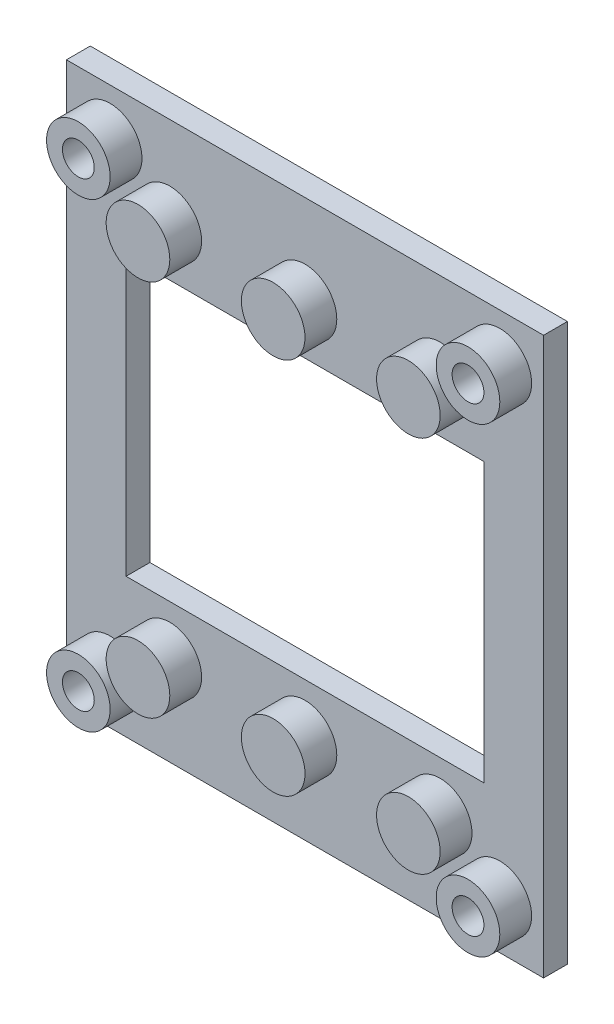
ISO-10303-21;
HEADER;
FILE_DESCRIPTION(('STEP AP214'),'2;1');
FILE_NAME('part.step','',(''),(''),'','','');
FILE_SCHEMA(('AUTOMOTIVE_DESIGN { 1 0 10303 214 1 1 1 1 }'));
ENDSEC;
DATA;
#1=APPLICATION_CONTEXT('core data for automotive mechanical design processes');
#2=APPLICATION_PROTOCOL_DEFINITION('international standard','automotive_design',2000,#1);
#3=PRODUCT_CONTEXT('',#1,'mechanical');
#4=PRODUCT('Part','Part','',(#3));
#5=PRODUCT_RELATED_PRODUCT_CATEGORY('part','',(#4));
#6=PRODUCT_DEFINITION_FORMATION('','',#4);
#7=PRODUCT_DEFINITION_CONTEXT('part definition',#1,'design');
#8=PRODUCT_DEFINITION('design','',#6,#7);
#9=PRODUCT_DEFINITION_SHAPE('','',#8);
#10=(LENGTH_UNIT() NAMED_UNIT(*) SI_UNIT(.MILLI.,.METRE.));
#11=(NAMED_UNIT(*) PLANE_ANGLE_UNIT() SI_UNIT($,.RADIAN.));
#12=(NAMED_UNIT(*) SI_UNIT($,.STERADIAN.) SOLID_ANGLE_UNIT());
#13=UNCERTAINTY_MEASURE_WITH_UNIT(LENGTH_MEASURE(1.E-05),#10,'distance_accuracy_value','');
#14=(GEOMETRIC_REPRESENTATION_CONTEXT(3) GLOBAL_UNCERTAINTY_ASSIGNED_CONTEXT((#13)) GLOBAL_UNIT_ASSIGNED_CONTEXT((#10,
#11,#12)) REPRESENTATION_CONTEXT('',''));
#15=CARTESIAN_POINT('',(0.,0.,0.));
#16=DIRECTION('',(0.,0.,1.));
#17=DIRECTION('',(1.,0.,0.));
#18=AXIS2_PLACEMENT_3D('',#15,#16,#17);
#19=CARTESIAN_POINT('',(0.,0.,0.));
#20=DIRECTION('',(0.,0.,1.));
#21=DIRECTION('',(1.,0.,0.));
#22=AXIS2_PLACEMENT_3D('',#19,#20,#21);
#23=PLANE('',#22);
#24=CARTESIAN_POINT('',(-1.67987721767761E-13,-23.75,0.));
#25=DIRECTION('',(0.,0.,1.));
#26=DIRECTION('',(1.,0.,0.));
#27=AXIS2_PLACEMENT_3D('',#24,#25,#26);
#28=CIRCLE('',#27,4.);
#29=CARTESIAN_POINT('',(3.99999999999983,-23.75,0.));
#30=VERTEX_POINT('',#29);
#31=EDGE_CURVE('E482',#30,#30,#28,.T.);
#32=ORIENTED_EDGE('',*,*,#31,.F.);
#33=EDGE_LOOP('',(#32));
#34=FACE_BOUND('',#33,.T.);
#35=CARTESIAN_POINT('',(16.9999999999998,23.75,0.));
#36=DIRECTION('',(0.,0.,1.));
#37=DIRECTION('',(1.,0.,0.));
#38=AXIS2_PLACEMENT_3D('',#35,#36,#37);
#39=CIRCLE('',#38,4.);
#40=CARTESIAN_POINT('',(20.9999999999998,23.75,0.));
#41=VERTEX_POINT('',#40);
#42=EDGE_CURVE('E492',#41,#41,#39,.T.);
#43=ORIENTED_EDGE('',*,*,#42,.F.);
#44=EDGE_LOOP('',(#43));
#45=FACE_BOUND('',#44,.T.);
#46=CARTESIAN_POINT('',(-17.0000000000002,23.75,0.));
#47=DIRECTION('',(0.,0.,1.));
#48=DIRECTION('',(1.,0.,0.));
#49=AXIS2_PLACEMENT_3D('',#46,#47,#48);
#50=CIRCLE('',#49,4.);
#51=CARTESIAN_POINT('',(-13.0000000000002,23.75,0.));
#52=VERTEX_POINT('',#51);
#53=EDGE_CURVE('E501',#52,#52,#50,.T.);
#54=ORIENTED_EDGE('',*,*,#53,.F.);
#55=EDGE_LOOP('',(#54));
#56=FACE_BOUND('',#55,.T.);
#57=DIRECTION('',(0.,1.,0.));
#58=VECTOR('',#57,1.);
#59=CARTESIAN_POINT('',(22.5,17.5,0.));
#60=LINE('',#59,#58);
#61=CARTESIAN_POINT('',(22.5,-17.5,0.));
#62=VERTEX_POINT('',#61);
#63=CARTESIAN_POINT('',(22.5,17.5,0.));
#64=VERTEX_POINT('',#63);
#65=EDGE_CURVE('E53',#62,#64,#60,.T.);
#66=ORIENTED_EDGE('',*,*,#65,.F.);
#67=DIRECTION('',(1.,0.,0.));
#68=VECTOR('',#67,1.);
#69=CARTESIAN_POINT('',(-22.5,-17.5,0.));
#70=LINE('',#69,#68);
#71=CARTESIAN_POINT('',(-22.5,-17.5,0.));
#72=VERTEX_POINT('',#71);
#73=EDGE_CURVE('E111',#72,#62,#70,.T.);
#74=ORIENTED_EDGE('',*,*,#73,.F.);
#75=DIRECTION('',(0.,-1.,0.));
#76=VECTOR('',#75,1.);
#77=CARTESIAN_POINT('',(-22.5,17.5,0.));
#78=LINE('',#77,#76);
#79=CARTESIAN_POINT('',(-22.5,17.5,0.));
#80=VERTEX_POINT('',#79);
#81=EDGE_CURVE('E131',#80,#72,#78,.T.);
#82=ORIENTED_EDGE('',*,*,#81,.F.);
#83=DIRECTION('',(-1.,0.,0.));
#84=VECTOR('',#83,1.);
#85=CARTESIAN_POINT('',(-22.5,17.5,0.));
#86=LINE('',#85,#84);
#87=EDGE_CURVE('E125',#64,#80,#86,.T.);
#88=ORIENTED_EDGE('',*,*,#87,.F.);
#89=EDGE_LOOP('',(#66,#74,#82,#88));
#90=FACE_BOUND('',#89,.T.);
#91=CARTESIAN_POINT('',(24.5,-29.,0.));
#92=DIRECTION('',(0.,0.,1.));
#93=DIRECTION('',(1.,0.,0.));
#94=AXIS2_PLACEMENT_3D('',#91,#92,#93);
#95=CIRCLE('',#94,4.);
#96=CARTESIAN_POINT('',(28.5,-29.,0.));
#97=VERTEX_POINT('',#96);
#98=EDGE_CURVE('E151',#97,#97,#95,.T.);
#99=ORIENTED_EDGE('',*,*,#98,.F.);
#100=EDGE_LOOP('',(#99));
#101=FACE_BOUND('',#100,.T.);
#102=CARTESIAN_POINT('',(-24.5,29.,0.));
#103=DIRECTION('',(0.,0.,1.));
#104=DIRECTION('',(1.,0.,0.));
#105=AXIS2_PLACEMENT_3D('',#102,#103,#104);
#106=CIRCLE('',#105,4.);
#107=CARTESIAN_POINT('',(-20.5,29.,0.));
#108=VERTEX_POINT('',#107);
#109=EDGE_CURVE('E169',#108,#108,#106,.T.);
#110=ORIENTED_EDGE('',*,*,#109,.F.);
#111=EDGE_LOOP('',(#110));
#112=FACE_BOUND('',#111,.T.);
#113=DIRECTION('',(0.,1.,0.));
#114=VECTOR('',#113,1.);
#115=CARTESIAN_POINT('',(30.,35.,0.));
#116=LINE('',#115,#114);
#117=CARTESIAN_POINT('',(30.,-35.,0.));
#118=VERTEX_POINT('',#117);
#119=CARTESIAN_POINT('',(30.,35.,0.));
#120=VERTEX_POINT('',#119);
#121=EDGE_CURVE('E193',#118,#120,#116,.T.);
#122=ORIENTED_EDGE('',*,*,#121,.T.);
#123=DIRECTION('',(-1.,0.,0.));
#124=VECTOR('',#123,1.);
#125=CARTESIAN_POINT('',(-30.,35.,0.));
#126=LINE('',#125,#124);
#127=CARTESIAN_POINT('',(-30.,35.,0.));
#128=VERTEX_POINT('',#127);
#129=EDGE_CURVE('E210',#120,#128,#126,.T.);
#130=ORIENTED_EDGE('',*,*,#129,.T.);
#131=DIRECTION('',(0.,-1.,0.));
#132=VECTOR('',#131,1.);
#133=CARTESIAN_POINT('',(-30.,35.,0.));
#134=LINE('',#133,#132);
#135=CARTESIAN_POINT('',(-30.,-35.,0.));
#136=VERTEX_POINT('',#135);
#137=EDGE_CURVE('E213',#128,#136,#134,.T.);
#138=ORIENTED_EDGE('',*,*,#137,.T.);
#139=DIRECTION('',(1.,0.,0.));
#140=VECTOR('',#139,1.);
#141=CARTESIAN_POINT('',(-30.,-35.,0.));
#142=LINE('',#141,#140);
#143=EDGE_CURVE('E198',#136,#118,#142,.T.);
#144=ORIENTED_EDGE('',*,*,#143,.T.);
#145=EDGE_LOOP('',(#122,#130,#138,#144));
#146=FACE_BOUND('',#145,.T.);
#147=CARTESIAN_POINT('',(24.4999999999998,29.,0.));
#148=DIRECTION('',(0.,0.,1.));
#149=DIRECTION('',(1.,0.,0.));
#150=AXIS2_PLACEMENT_3D('',#147,#148,#149);
#151=CIRCLE('',#150,4.);
#152=CARTESIAN_POINT('',(28.4999999999998,29.,0.));
#153=VERTEX_POINT('',#152);
#154=EDGE_CURVE('E160',#153,#153,#151,.T.);
#155=ORIENTED_EDGE('',*,*,#154,.F.);
#156=EDGE_LOOP('',(#155));
#157=FACE_BOUND('',#156,.T.);
#158=CARTESIAN_POINT('',(-24.5,-29.,0.));
#159=DIRECTION('',(0.,0.,1.));
#160=DIRECTION('',(1.,0.,0.));
#161=AXIS2_PLACEMENT_3D('',#158,#159,#160);
#162=CIRCLE('',#161,4.);
#163=CARTESIAN_POINT('',(-20.5,-29.,0.));
#164=VERTEX_POINT('',#163);
#165=EDGE_CURVE('E142',#164,#164,#162,.T.);
#166=ORIENTED_EDGE('',*,*,#165,.F.);
#167=EDGE_LOOP('',(#166));
#168=FACE_BOUND('',#167,.T.);
#169=CARTESIAN_POINT('',(-1.65079185619786E-13,23.75,0.));
#170=DIRECTION('',(0.,0.,1.));
#171=DIRECTION('',(1.,0.,0.));
#172=AXIS2_PLACEMENT_3D('',#169,#170,#171);
#173=CIRCLE('',#172,4.);
#174=CARTESIAN_POINT('',(3.99999999999984,23.75,0.));
#175=VERTEX_POINT('',#174);
#176=EDGE_CURVE('E497',#175,#175,#173,.T.);
#177=ORIENTED_EDGE('',*,*,#176,.F.);
#178=EDGE_LOOP('',(#177));
#179=FACE_BOUND('',#178,.T.);
#180=CARTESIAN_POINT('',(16.9999999999998,-23.75,0.));
#181=DIRECTION('',(0.,0.,1.));
#182=DIRECTION('',(1.,0.,0.));
#183=AXIS2_PLACEMENT_3D('',#180,#181,#182);
#184=CIRCLE('',#183,4.);
#185=CARTESIAN_POINT('',(20.9999999999998,-23.75,0.));
#186=VERTEX_POINT('',#185);
#187=EDGE_CURVE('E487',#186,#186,#184,.T.);
#188=ORIENTED_EDGE('',*,*,#187,.F.);
#189=EDGE_LOOP('',(#188));
#190=FACE_BOUND('',#189,.T.);
#191=CARTESIAN_POINT('',(-17.0000000000002,-23.75,0.));
#192=DIRECTION('',(0.,0.,1.));
#193=DIRECTION('',(1.,0.,0.));
#194=AXIS2_PLACEMENT_3D('',#191,#192,#193);
#195=CIRCLE('',#194,4.);
#196=CARTESIAN_POINT('',(-13.0000000000002,-23.75,0.));
#197=VERTEX_POINT('',#196);
#198=EDGE_CURVE('E479',#197,#197,#195,.T.);
#199=ORIENTED_EDGE('',*,*,#198,.F.);
#200=EDGE_LOOP('',(#199));
#201=FACE_BOUND('',#200,.T.);
#202=ADVANCED_FACE('F38',(#34,#45,#56,#90,#101,#112,#146,#157,#168,#179,#190,#201),#23,.T.);
#203=CARTESIAN_POINT('',(24.4999999999998,29.,-3.001));
#204=DIRECTION('',(0.,0.,1.));
#205=DIRECTION('',(1.,0.,0.));
#206=AXIS2_PLACEMENT_3D('',#203,#204,#205);
#207=CYLINDRICAL_SURFACE('',#206,2.);
#208=CARTESIAN_POINT('',(24.4999999999998,29.,4.));
#209=DIRECTION('',(0.,0.,1.));
#210=DIRECTION('',(1.,0.,0.));
#211=AXIS2_PLACEMENT_3D('',#208,#209,#210);
#212=CIRCLE('',#211,2.);
#213=CARTESIAN_POINT('',(26.4999999999998,29.,4.));
#214=VERTEX_POINT('',#213);
#215=EDGE_CURVE('E155',#214,#214,#212,.T.);
#216=ORIENTED_EDGE('',*,*,#215,.T.);
#217=EDGE_LOOP('',(#216));
#218=FACE_BOUND('',#217,.T.);
#219=CARTESIAN_POINT('',(24.4999999999998,29.,-2.));
#220=DIRECTION('',(0.,0.,-1.));
#221=DIRECTION('',(-1.,0.,0.));
#222=AXIS2_PLACEMENT_3D('',#219,#220,#221);
#223=CIRCLE('',#222,2.);
#224=CARTESIAN_POINT('',(22.4999999999998,29.,-2.));
#225=VERTEX_POINT('',#224);
#226=EDGE_CURVE('E11',#225,#225,#223,.F.);
#227=ORIENTED_EDGE('',*,*,#226,.F.);
#228=EDGE_LOOP('',(#227));
#229=FACE_BOUND('',#228,.T.);
#230=ADVANCED_FACE('F238',(#218,#229),#207,.F.);
#231=CARTESIAN_POINT('',(-24.5,29.,-3.001));
#232=DIRECTION('',(0.,0.,1.));
#233=DIRECTION('',(1.,0.,0.));
#234=AXIS2_PLACEMENT_3D('',#231,#232,#233);
#235=CYLINDRICAL_SURFACE('',#234,2.);
#236=CARTESIAN_POINT('',(-24.5,29.,4.));
#237=DIRECTION('',(0.,0.,1.));
#238=DIRECTION('',(1.,0.,0.));
#239=AXIS2_PLACEMENT_3D('',#236,#237,#238);
#240=CIRCLE('',#239,2.);
#241=CARTESIAN_POINT('',(-22.5,29.,4.));
#242=VERTEX_POINT('',#241);
#243=EDGE_CURVE('E164',#242,#242,#240,.T.);
#244=ORIENTED_EDGE('',*,*,#243,.T.);
#245=EDGE_LOOP('',(#244));
#246=FACE_BOUND('',#245,.T.);
#247=CARTESIAN_POINT('',(-24.5,29.,-2.));
#248=DIRECTION('',(0.,0.,-1.));
#249=DIRECTION('',(-1.,0.,0.));
#250=AXIS2_PLACEMENT_3D('',#247,#248,#249);
#251=CIRCLE('',#250,2.);
#252=CARTESIAN_POINT('',(-26.5,29.,-2.));
#253=VERTEX_POINT('',#252);
#254=EDGE_CURVE('E46',#253,#253,#251,.F.);
#255=ORIENTED_EDGE('',*,*,#254,.F.);
#256=EDGE_LOOP('',(#255));
#257=FACE_BOUND('',#256,.T.);
#258=ADVANCED_FACE('F235',(#246,#257),#235,.F.);
#259=CARTESIAN_POINT('',(-24.5,-29.,-3.001));
#260=DIRECTION('',(0.,0.,1.));
#261=DIRECTION('',(1.,0.,0.));
#262=AXIS2_PLACEMENT_3D('',#259,#260,#261);
#263=CYLINDRICAL_SURFACE('',#262,2.);
#264=CARTESIAN_POINT('',(-24.5,-29.,4.));
#265=DIRECTION('',(0.,0.,1.));
#266=DIRECTION('',(1.,0.,0.));
#267=AXIS2_PLACEMENT_3D('',#264,#265,#266);
#268=CIRCLE('',#267,2.);
#269=CARTESIAN_POINT('',(-22.5,-29.,4.));
#270=VERTEX_POINT('',#269);
#271=EDGE_CURVE('E117',#270,#270,#268,.T.);
#272=ORIENTED_EDGE('',*,*,#271,.T.);
#273=EDGE_LOOP('',(#272));
#274=FACE_BOUND('',#273,.T.);
#275=CARTESIAN_POINT('',(-24.5,-29.,-2.));
#276=DIRECTION('',(0.,0.,-1.));
#277=DIRECTION('',(-1.,0.,0.));
#278=AXIS2_PLACEMENT_3D('',#275,#276,#277);
#279=CIRCLE('',#278,2.);
#280=CARTESIAN_POINT('',(-26.5,-29.,-2.));
#281=VERTEX_POINT('',#280);
#282=EDGE_CURVE('E228',#281,#281,#279,.F.);
#283=ORIENTED_EDGE('',*,*,#282,.F.);
#284=EDGE_LOOP('',(#283));
#285=FACE_BOUND('',#284,.T.);
#286=ADVANCED_FACE('F237',(#274,#285),#263,.F.);
#287=CARTESIAN_POINT('',(24.5,-29.,-3.001));
#288=DIRECTION('',(0.,0.,1.));
#289=DIRECTION('',(1.,0.,0.));
#290=AXIS2_PLACEMENT_3D('',#287,#288,#289);
#291=CYLINDRICAL_SURFACE('',#290,2.);
#292=CARTESIAN_POINT('',(24.5,-29.,4.));
#293=DIRECTION('',(0.,0.,1.));
#294=DIRECTION('',(1.,0.,0.));
#295=AXIS2_PLACEMENT_3D('',#292,#293,#294);
#296=CIRCLE('',#295,2.);
#297=CARTESIAN_POINT('',(26.5,-29.,4.));
#298=VERTEX_POINT('',#297);
#299=EDGE_CURVE('E146',#298,#298,#296,.T.);
#300=ORIENTED_EDGE('',*,*,#299,.T.);
#301=EDGE_LOOP('',(#300));
#302=FACE_BOUND('',#301,.T.);
#303=CARTESIAN_POINT('',(24.5,-29.,-2.));
#304=DIRECTION('',(0.,0.,-1.));
#305=DIRECTION('',(-1.,0.,0.));
#306=AXIS2_PLACEMENT_3D('',#303,#304,#305);
#307=CIRCLE('',#306,2.);
#308=CARTESIAN_POINT('',(22.5,-29.,-2.));
#309=VERTEX_POINT('',#308);
#310=EDGE_CURVE('E220',#309,#309,#307,.F.);
#311=ORIENTED_EDGE('',*,*,#310,.F.);
#312=EDGE_LOOP('',(#311));
#313=FACE_BOUND('',#312,.T.);
#314=ADVANCED_FACE('F245',(#302,#313),#291,.F.);
#315=CARTESIAN_POINT('',(30.,35.,-3.));
#316=DIRECTION('',(1.,0.,0.));
#317=DIRECTION('',(0.,1.,0.));
#318=AXIS2_PLACEMENT_3D('',#315,#316,#317);
#319=PLANE('',#318);
#320=ORIENTED_EDGE('',*,*,#121,.F.);
#321=DIRECTION('',(0.,0.,1.));
#322=VECTOR('',#321,1.);
#323=CARTESIAN_POINT('',(30.,-35.,-3.));
#324=LINE('',#323,#322);
#325=CARTESIAN_POINT('',(30.,-35.,-3.));
#326=VERTEX_POINT('',#325);
#327=EDGE_CURVE('E218',#326,#118,#324,.T.);
#328=ORIENTED_EDGE('',*,*,#327,.F.);
#329=DIRECTION('',(0.,1.,0.));
#330=VECTOR('',#329,1.);
#331=CARTESIAN_POINT('',(30.,35.,-3.));
#332=LINE('',#331,#330);
#333=CARTESIAN_POINT('',(30.,35.,-3.));
#334=VERTEX_POINT('',#333);
#335=EDGE_CURVE('E194',#326,#334,#332,.T.);
#336=ORIENTED_EDGE('',*,*,#335,.T.);
#337=DIRECTION('',(0.,0.,1.));
#338=VECTOR('',#337,1.);
#339=CARTESIAN_POINT('',(30.,35.,-3.));
#340=LINE('',#339,#338);
#341=EDGE_CURVE('E207',#334,#120,#340,.T.);
#342=ORIENTED_EDGE('',*,*,#341,.T.);
#343=EDGE_LOOP('',(#320,#328,#336,#342));
#344=FACE_BOUND('',#343,.T.);
#345=ADVANCED_FACE('F40',(#344),#319,.T.);
#346=CARTESIAN_POINT('',(-30.,-35.,-3.));
#347=DIRECTION('',(0.,-1.,0.));
#348=DIRECTION('',(0.,0.,-1.));
#349=AXIS2_PLACEMENT_3D('',#346,#347,#348);
#350=PLANE('',#349);
#351=ORIENTED_EDGE('',*,*,#143,.F.);
#352=DIRECTION('',(0.,0.,1.));
#353=VECTOR('',#352,1.);
#354=CARTESIAN_POINT('',(-30.,-35.,-3.));
#355=LINE('',#354,#353);
#356=CARTESIAN_POINT('',(-30.,-35.,-3.));
#357=VERTEX_POINT('',#356);
#358=EDGE_CURVE('E221',#357,#136,#355,.T.);
#359=ORIENTED_EDGE('',*,*,#358,.F.);
#360=DIRECTION('',(1.,0.,0.));
#361=VECTOR('',#360,1.);
#362=CARTESIAN_POINT('',(-30.,-35.,-3.));
#363=LINE('',#362,#361);
#364=EDGE_CURVE('E204',#357,#326,#363,.T.);
#365=ORIENTED_EDGE('',*,*,#364,.T.);
#366=ORIENTED_EDGE('',*,*,#327,.T.);
#367=EDGE_LOOP('',(#351,#359,#365,#366));
#368=FACE_BOUND('',#367,.T.);
#369=ADVANCED_FACE('F259',(#368),#350,.T.);
#370=CARTESIAN_POINT('',(-30.,35.,-3.));
#371=DIRECTION('',(-1.,0.,0.));
#372=DIRECTION('',(0.,-1.,0.));
#373=AXIS2_PLACEMENT_3D('',#370,#371,#372);
#374=PLANE('',#373);
#375=ORIENTED_EDGE('',*,*,#137,.F.);
#376=DIRECTION('',(0.,0.,1.));
#377=VECTOR('',#376,1.);
#378=CARTESIAN_POINT('',(-30.,35.,-3.));
#379=LINE('',#378,#377);
#380=CARTESIAN_POINT('',(-30.,35.,-3.));
#381=VERTEX_POINT('',#380);
#382=EDGE_CURVE('E223',#381,#128,#379,.T.);
#383=ORIENTED_EDGE('',*,*,#382,.F.);
#384=DIRECTION('',(0.,-1.,0.));
#385=VECTOR('',#384,1.);
#386=CARTESIAN_POINT('',(-30.,35.,-3.));
#387=LINE('',#386,#385);
#388=EDGE_CURVE('E201',#381,#357,#387,.T.);
#389=ORIENTED_EDGE('',*,*,#388,.T.);
#390=ORIENTED_EDGE('',*,*,#358,.T.);
#391=EDGE_LOOP('',(#375,#383,#389,#390));
#392=FACE_BOUND('',#391,.T.);
#393=ADVANCED_FACE('F262',(#392),#374,.T.);
#394=CARTESIAN_POINT('',(-30.,35.,-3.));
#395=DIRECTION('',(0.,1.,0.));
#396=DIRECTION('',(0.,0.,1.));
#397=AXIS2_PLACEMENT_3D('',#394,#395,#396);
#398=PLANE('',#397);
#399=ORIENTED_EDGE('',*,*,#129,.F.);
#400=ORIENTED_EDGE('',*,*,#341,.F.);
#401=DIRECTION('',(-1.,0.,0.));
#402=VECTOR('',#401,1.);
#403=CARTESIAN_POINT('',(-30.,35.,-3.));
#404=LINE('',#403,#402);
#405=EDGE_CURVE('E197',#334,#381,#404,.T.);
#406=ORIENTED_EDGE('',*,*,#405,.T.);
#407=ORIENTED_EDGE('',*,*,#382,.T.);
#408=EDGE_LOOP('',(#399,#400,#406,#407));
#409=FACE_BOUND('',#408,.T.);
#410=ADVANCED_FACE('F265',(#409),#398,.T.);
#411=CARTESIAN_POINT('',(0.,0.,-3.));
#412=DIRECTION('',(0.,0.,1.));
#413=DIRECTION('',(1.,0.,0.));
#414=AXIS2_PLACEMENT_3D('',#411,#412,#413);
#415=PLANE('',#414);
#416=DIRECTION('',(-1.,0.,0.));
#417=VECTOR('',#416,1.);
#418=CARTESIAN_POINT('',(-22.5,-17.5,-3.));
#419=LINE('',#418,#417);
#420=CARTESIAN_POINT('',(22.5,-17.5,-3.));
#421=VERTEX_POINT('',#420);
#422=CARTESIAN_POINT('',(-22.5,-17.5,-3.));
#423=VERTEX_POINT('',#422);
#424=EDGE_CURVE('E123',#421,#423,#419,.T.);
#425=ORIENTED_EDGE('',*,*,#424,.F.);
#426=DIRECTION('',(0.,-1.,0.));
#427=VECTOR('',#426,1.);
#428=CARTESIAN_POINT('',(22.5,17.5,-3.));
#429=LINE('',#428,#427);
#430=CARTESIAN_POINT('',(22.5,17.5,-3.));
#431=VERTEX_POINT('',#430);
#432=EDGE_CURVE('E105',#431,#421,#429,.T.);
#433=ORIENTED_EDGE('',*,*,#432,.F.);
#434=DIRECTION('',(1.,0.,0.));
#435=VECTOR('',#434,1.);
#436=CARTESIAN_POINT('',(-22.5,17.5,-3.));
#437=LINE('',#436,#435);
#438=CARTESIAN_POINT('',(-22.5,17.5,-3.));
#439=VERTEX_POINT('',#438);
#440=EDGE_CURVE('E114',#439,#431,#437,.T.);
#441=ORIENTED_EDGE('',*,*,#440,.F.);
#442=DIRECTION('',(0.,1.,0.));
#443=VECTOR('',#442,1.);
#444=CARTESIAN_POINT('',(-22.5,17.5,-3.));
#445=LINE('',#444,#443);
#446=EDGE_CURVE('E61',#423,#439,#445,.T.);
#447=ORIENTED_EDGE('',*,*,#446,.F.);
#448=EDGE_LOOP('',(#425,#433,#441,#447));
#449=FACE_BOUND('',#448,.T.);
#450=CARTESIAN_POINT('',(-17.0000000000002,23.75,-3.));
#451=DIRECTION('',(0.,0.,1.));
#452=DIRECTION('',(1.,0.,0.));
#453=AXIS2_PLACEMENT_3D('',#450,#451,#452);
#454=CIRCLE('',#453,2.);
#455=CARTESIAN_POINT('',(-15.0000000000002,23.75,-3.));
#456=VERTEX_POINT('',#455);
#457=EDGE_CURVE('E173',#456,#456,#454,.F.);
#458=ORIENTED_EDGE('',*,*,#457,.F.);
#459=EDGE_LOOP('',(#458));
#460=FACE_BOUND('',#459,.T.);
#461=CARTESIAN_POINT('',(16.9999999999998,23.75,-3.));
#462=DIRECTION('',(0.,0.,1.));
#463=DIRECTION('',(1.,0.,0.));
#464=AXIS2_PLACEMENT_3D('',#461,#462,#463);
#465=CIRCLE('',#464,2.);
#466=CARTESIAN_POINT('',(18.9999999999998,23.75,-3.));
#467=VERTEX_POINT('',#466);
#468=EDGE_CURVE('E186',#467,#467,#465,.F.);
#469=ORIENTED_EDGE('',*,*,#468,.F.);
#470=EDGE_LOOP('',(#469));
#471=FACE_BOUND('',#470,.T.);
#472=CARTESIAN_POINT('',(-1.65079185619786E-13,23.75,-3.));
#473=DIRECTION('',(0.,0.,1.));
#474=DIRECTION('',(1.,0.,0.));
#475=AXIS2_PLACEMENT_3D('',#472,#473,#474);
#476=CIRCLE('',#475,2.);
#477=CARTESIAN_POINT('',(1.99999999999984,23.75,-3.));
#478=VERTEX_POINT('',#477);
#479=EDGE_CURVE('E183',#478,#478,#476,.F.);
#480=ORIENTED_EDGE('',*,*,#479,.F.);
#481=EDGE_LOOP('',(#480));
#482=FACE_BOUND('',#481,.T.);
#483=CARTESIAN_POINT('',(16.9999999999998,-23.75,-3.));
#484=DIRECTION('',(0.,0.,1.));
#485=DIRECTION('',(1.,0.,0.));
#486=AXIS2_PLACEMENT_3D('',#483,#484,#485);
#487=CIRCLE('',#486,2.);
#488=CARTESIAN_POINT('',(18.9999999999998,-23.75,-3.));
#489=VERTEX_POINT('',#488);
#490=EDGE_CURVE('E180',#489,#489,#487,.F.);
#491=ORIENTED_EDGE('',*,*,#490,.F.);
#492=EDGE_LOOP('',(#491));
#493=FACE_BOUND('',#492,.T.);
#494=CARTESIAN_POINT('',(-1.67987721767761E-13,-23.75,-3.));
#495=DIRECTION('',(0.,0.,1.));
#496=DIRECTION('',(1.,0.,0.));
#497=AXIS2_PLACEMENT_3D('',#494,#495,#496);
#498=CIRCLE('',#497,2.);
#499=CARTESIAN_POINT('',(1.99999999999983,-23.75,-3.));
#500=VERTEX_POINT('',#499);
#501=EDGE_CURVE('E176',#500,#500,#498,.F.);
#502=ORIENTED_EDGE('',*,*,#501,.F.);
#503=EDGE_LOOP('',(#502));
#504=FACE_BOUND('',#503,.T.);
#505=CARTESIAN_POINT('',(-17.0000000000002,-23.75,-3.));
#506=DIRECTION('',(0.,0.,1.));
#507=DIRECTION('',(1.,0.,0.));
#508=AXIS2_PLACEMENT_3D('',#505,#506,#507);
#509=CIRCLE('',#508,2.);
#510=CARTESIAN_POINT('',(-15.0000000000002,-23.75,-3.));
#511=VERTEX_POINT('',#510);
#512=EDGE_CURVE('E179',#511,#511,#509,.F.);
#513=ORIENTED_EDGE('',*,*,#512,.F.);
#514=EDGE_LOOP('',(#513));
#515=FACE_BOUND('',#514,.T.);
#516=ORIENTED_EDGE('',*,*,#335,.F.);
#517=ORIENTED_EDGE('',*,*,#364,.F.);
#518=ORIENTED_EDGE('',*,*,#388,.F.);
#519=ORIENTED_EDGE('',*,*,#405,.F.);
#520=EDGE_LOOP('',(#516,#517,#518,#519));
#521=FACE_BOUND('',#520,.T.);
#522=ADVANCED_FACE('F120',(#449,#460,#471,#482,#493,#504,#515,#521),#415,.F.);
#523=CARTESIAN_POINT('',(-17.0000000000002,-23.75,-3.001));
#524=DIRECTION('',(0.,0.,1.));
#525=DIRECTION('',(1.,0.,0.));
#526=AXIS2_PLACEMENT_3D('',#523,#524,#525);
#527=CYLINDRICAL_SURFACE('',#526,2.);
#528=ORIENTED_EDGE('',*,*,#512,.T.);
#529=EDGE_LOOP('',(#528));
#530=FACE_BOUND('',#529,.T.);
#531=CARTESIAN_POINT('',(-17.0000000000002,-23.75,3.));
#532=DIRECTION('',(0.,0.,1.));
#533=DIRECTION('',(1.,0.,0.));
#534=AXIS2_PLACEMENT_3D('',#531,#532,#533);
#535=CIRCLE('',#534,2.);
#536=CARTESIAN_POINT('',(-15.0000000000002,-23.75,3.));
#537=VERTEX_POINT('',#536);
#538=EDGE_CURVE('E476',#537,#537,#535,.T.);
#539=ORIENTED_EDGE('',*,*,#538,.T.);
#540=EDGE_LOOP('',(#539));
#541=FACE_BOUND('',#540,.T.);
#542=ADVANCED_FACE('F272',(#530,#541),#527,.F.);
#543=CARTESIAN_POINT('',(-1.67987721767761E-13,-23.75,-3.001));
#544=DIRECTION('',(0.,0.,1.));
#545=DIRECTION('',(1.,0.,0.));
#546=AXIS2_PLACEMENT_3D('',#543,#544,#545);
#547=CYLINDRICAL_SURFACE('',#546,2.);
#548=ORIENTED_EDGE('',*,*,#501,.T.);
#549=EDGE_LOOP('',(#548));
#550=FACE_BOUND('',#549,.T.);
#551=CARTESIAN_POINT('',(-1.67987721767761E-13,-23.75,3.));
#552=DIRECTION('',(0.,0.,1.));
#553=DIRECTION('',(1.,0.,0.));
#554=AXIS2_PLACEMENT_3D('',#551,#552,#553);
#555=CIRCLE('',#554,2.);
#556=CARTESIAN_POINT('',(1.99999999999983,-23.75,3.));
#557=VERTEX_POINT('',#556);
#558=EDGE_CURVE('E472',#557,#557,#555,.T.);
#559=ORIENTED_EDGE('',*,*,#558,.T.);
#560=EDGE_LOOP('',(#559));
#561=FACE_BOUND('',#560,.T.);
#562=ADVANCED_FACE('F297',(#550,#561),#547,.F.);
#563=CARTESIAN_POINT('',(16.9999999999998,-23.75,-3.001));
#564=DIRECTION('',(0.,0.,1.));
#565=DIRECTION('',(1.,0.,0.));
#566=AXIS2_PLACEMENT_3D('',#563,#564,#565);
#567=CYLINDRICAL_SURFACE('',#566,2.);
#568=ORIENTED_EDGE('',*,*,#490,.T.);
#569=EDGE_LOOP('',(#568));
#570=FACE_BOUND('',#569,.T.);
#571=CARTESIAN_POINT('',(16.9999999999998,-23.75,3.));
#572=DIRECTION('',(0.,0.,1.));
#573=DIRECTION('',(1.,0.,0.));
#574=AXIS2_PLACEMENT_3D('',#571,#572,#573);
#575=CIRCLE('',#574,2.);
#576=CARTESIAN_POINT('',(18.9999999999998,-23.75,3.));
#577=VERTEX_POINT('',#576);
#578=EDGE_CURVE('E468',#577,#577,#575,.T.);
#579=ORIENTED_EDGE('',*,*,#578,.T.);
#580=EDGE_LOOP('',(#579));
#581=FACE_BOUND('',#580,.T.);
#582=ADVANCED_FACE('F311',(#570,#581),#567,.F.);
#583=CARTESIAN_POINT('',(-1.65079185619786E-13,23.75,-3.001));
#584=DIRECTION('',(0.,0.,1.));
#585=DIRECTION('',(1.,0.,0.));
#586=AXIS2_PLACEMENT_3D('',#583,#584,#585);
#587=CYLINDRICAL_SURFACE('',#586,2.);
#588=ORIENTED_EDGE('',*,*,#479,.T.);
#589=EDGE_LOOP('',(#588));
#590=FACE_BOUND('',#589,.T.);
#591=CARTESIAN_POINT('',(-1.65079185619786E-13,23.75,3.));
#592=DIRECTION('',(0.,0.,1.));
#593=DIRECTION('',(1.,0.,0.));
#594=AXIS2_PLACEMENT_3D('',#591,#592,#593);
#595=CIRCLE('',#594,2.);
#596=CARTESIAN_POINT('',(1.99999999999984,23.75,3.));
#597=VERTEX_POINT('',#596);
#598=EDGE_CURVE('E460',#597,#597,#595,.T.);
#599=ORIENTED_EDGE('',*,*,#598,.T.);
#600=EDGE_LOOP('',(#599));
#601=FACE_BOUND('',#600,.T.);
#602=ADVANCED_FACE('F307',(#590,#601),#587,.F.);
#603=CARTESIAN_POINT('',(16.9999999999998,23.75,-3.001));
#604=DIRECTION('',(0.,0.,1.));
#605=DIRECTION('',(1.,0.,0.));
#606=AXIS2_PLACEMENT_3D('',#603,#604,#605);
#607=CYLINDRICAL_SURFACE('',#606,2.);
#608=ORIENTED_EDGE('',*,*,#468,.T.);
#609=EDGE_LOOP('',(#608));
#610=FACE_BOUND('',#609,.T.);
#611=CARTESIAN_POINT('',(16.9999999999998,23.75,3.));
#612=DIRECTION('',(0.,0.,1.));
#613=DIRECTION('',(1.,0.,0.));
#614=AXIS2_PLACEMENT_3D('',#611,#612,#613);
#615=CIRCLE('',#614,2.);
#616=CARTESIAN_POINT('',(18.9999999999998,23.75,3.));
#617=VERTEX_POINT('',#616);
#618=EDGE_CURVE('E464',#617,#617,#615,.T.);
#619=ORIENTED_EDGE('',*,*,#618,.T.);
#620=EDGE_LOOP('',(#619));
#621=FACE_BOUND('',#620,.T.);
#622=ADVANCED_FACE('F303',(#610,#621),#607,.F.);
#623=CARTESIAN_POINT('',(-17.0000000000002,23.75,-3.001));
#624=DIRECTION('',(0.,0.,1.));
#625=DIRECTION('',(1.,0.,0.));
#626=AXIS2_PLACEMENT_3D('',#623,#624,#625);
#627=CYLINDRICAL_SURFACE('',#626,2.);
#628=ORIENTED_EDGE('',*,*,#457,.T.);
#629=EDGE_LOOP('',(#628));
#630=FACE_BOUND('',#629,.T.);
#631=CARTESIAN_POINT('',(-17.0000000000002,23.75,3.));
#632=DIRECTION('',(0.,0.,1.));
#633=DIRECTION('',(1.,0.,0.));
#634=AXIS2_PLACEMENT_3D('',#631,#632,#633);
#635=CIRCLE('',#634,2.);
#636=CARTESIAN_POINT('',(-15.0000000000002,23.75,3.));
#637=VERTEX_POINT('',#636);
#638=EDGE_CURVE('E452',#637,#637,#635,.T.);
#639=ORIENTED_EDGE('',*,*,#638,.T.);
#640=EDGE_LOOP('',(#639));
#641=FACE_BOUND('',#640,.T.);
#642=ADVANCED_FACE('F299',(#630,#641),#627,.F.);
#643=CARTESIAN_POINT('',(-24.5,29.,4.));
#644=DIRECTION('',(0.,0.,1.));
#645=DIRECTION('',(1.,0.,0.));
#646=AXIS2_PLACEMENT_3D('',#643,#644,#645);
#647=PLANE('',#646);
#648=CARTESIAN_POINT('',(-24.5,29.,4.));
#649=DIRECTION('',(0.,0.,1.));
#650=DIRECTION('',(1.,0.,0.));
#651=AXIS2_PLACEMENT_3D('',#648,#649,#650);
#652=CIRCLE('',#651,4.);
#653=CARTESIAN_POINT('',(-20.5,29.,4.));
#654=VERTEX_POINT('',#653);
#655=EDGE_CURVE('E170',#654,#654,#652,.T.);
#656=ORIENTED_EDGE('',*,*,#655,.T.);
#657=EDGE_LOOP('',(#656));
#658=FACE_BOUND('',#657,.T.);
#659=ORIENTED_EDGE('',*,*,#243,.F.);
#660=EDGE_LOOP('',(#659));
#661=FACE_BOUND('',#660,.T.);
#662=ADVANCED_FACE('F302',(#658,#661),#647,.T.);
#663=CARTESIAN_POINT('',(-24.5,29.,4.));
#664=DIRECTION('',(0.,0.,-1.));
#665=DIRECTION('',(-1.,0.,0.));
#666=AXIS2_PLACEMENT_3D('',#663,#664,#665);
#667=CYLINDRICAL_SURFACE('',#666,4.);
#668=ORIENTED_EDGE('',*,*,#655,.F.);
#669=EDGE_LOOP('',(#668));
#670=FACE_BOUND('',#669,.T.);
#671=ORIENTED_EDGE('',*,*,#109,.T.);
#672=EDGE_LOOP('',(#671));
#673=FACE_BOUND('',#672,.T.);
#674=ADVANCED_FACE('F319',(#670,#673),#667,.T.);
#675=CARTESIAN_POINT('',(24.4999999999998,29.,4.));
#676=DIRECTION('',(0.,0.,1.));
#677=DIRECTION('',(1.,0.,0.));
#678=AXIS2_PLACEMENT_3D('',#675,#676,#677);
#679=PLANE('',#678);
#680=CARTESIAN_POINT('',(24.4999999999998,29.,4.));
#681=DIRECTION('',(0.,0.,1.));
#682=DIRECTION('',(1.,0.,0.));
#683=AXIS2_PLACEMENT_3D('',#680,#681,#682);
#684=CIRCLE('',#683,4.);
#685=CARTESIAN_POINT('',(28.4999999999998,29.,4.));
#686=VERTEX_POINT('',#685);
#687=EDGE_CURVE('E161',#686,#686,#684,.T.);
#688=ORIENTED_EDGE('',*,*,#687,.T.);
#689=EDGE_LOOP('',(#688));
#690=FACE_BOUND('',#689,.T.);
#691=ORIENTED_EDGE('',*,*,#215,.F.);
#692=EDGE_LOOP('',(#691));
#693=FACE_BOUND('',#692,.T.);
#694=ADVANCED_FACE('F322',(#690,#693),#679,.T.);
#695=CARTESIAN_POINT('',(24.4999999999998,29.,4.));
#696=DIRECTION('',(0.,0.,-1.));
#697=DIRECTION('',(-1.,0.,0.));
#698=AXIS2_PLACEMENT_3D('',#695,#696,#697);
#699=CYLINDRICAL_SURFACE('',#698,4.);
#700=ORIENTED_EDGE('',*,*,#687,.F.);
#701=EDGE_LOOP('',(#700));
#702=FACE_BOUND('',#701,.T.);
#703=ORIENTED_EDGE('',*,*,#154,.T.);
#704=EDGE_LOOP('',(#703));
#705=FACE_BOUND('',#704,.T.);
#706=ADVANCED_FACE('F327',(#702,#705),#699,.T.);
#707=CARTESIAN_POINT('',(24.5,-29.,4.));
#708=DIRECTION('',(0.,0.,1.));
#709=DIRECTION('',(1.,0.,0.));
#710=AXIS2_PLACEMENT_3D('',#707,#708,#709);
#711=PLANE('',#710);
#712=CARTESIAN_POINT('',(24.5,-29.,4.));
#713=DIRECTION('',(0.,0.,1.));
#714=DIRECTION('',(1.,0.,0.));
#715=AXIS2_PLACEMENT_3D('',#712,#713,#714);
#716=CIRCLE('',#715,4.);
#717=CARTESIAN_POINT('',(28.5,-29.,4.));
#718=VERTEX_POINT('',#717);
#719=EDGE_CURVE('E152',#718,#718,#716,.T.);
#720=ORIENTED_EDGE('',*,*,#719,.T.);
#721=EDGE_LOOP('',(#720));
#722=FACE_BOUND('',#721,.T.);
#723=ORIENTED_EDGE('',*,*,#299,.F.);
#724=EDGE_LOOP('',(#723));
#725=FACE_BOUND('',#724,.T.);
#726=ADVANCED_FACE('F330',(#722,#725),#711,.T.);
#727=CARTESIAN_POINT('',(24.5,-29.,4.));
#728=DIRECTION('',(0.,0.,-1.));
#729=DIRECTION('',(-1.,0.,0.));
#730=AXIS2_PLACEMENT_3D('',#727,#728,#729);
#731=CYLINDRICAL_SURFACE('',#730,4.);
#732=ORIENTED_EDGE('',*,*,#719,.F.);
#733=EDGE_LOOP('',(#732));
#734=FACE_BOUND('',#733,.T.);
#735=ORIENTED_EDGE('',*,*,#98,.T.);
#736=EDGE_LOOP('',(#735));
#737=FACE_BOUND('',#736,.T.);
#738=ADVANCED_FACE('F335',(#734,#737),#731,.T.);
#739=CARTESIAN_POINT('',(-24.5,-29.,4.));
#740=DIRECTION('',(0.,0.,1.));
#741=DIRECTION('',(1.,0.,0.));
#742=AXIS2_PLACEMENT_3D('',#739,#740,#741);
#743=PLANE('',#742);
#744=CARTESIAN_POINT('',(-24.5,-29.,4.));
#745=DIRECTION('',(0.,0.,1.));
#746=DIRECTION('',(1.,0.,0.));
#747=AXIS2_PLACEMENT_3D('',#744,#745,#746);
#748=CIRCLE('',#747,4.);
#749=CARTESIAN_POINT('',(-20.5,-29.,4.));
#750=VERTEX_POINT('',#749);
#751=EDGE_CURVE('E143',#750,#750,#748,.T.);
#752=ORIENTED_EDGE('',*,*,#751,.T.);
#753=EDGE_LOOP('',(#752));
#754=FACE_BOUND('',#753,.T.);
#755=ORIENTED_EDGE('',*,*,#271,.F.);
#756=EDGE_LOOP('',(#755));
#757=FACE_BOUND('',#756,.T.);
#758=ADVANCED_FACE('F338',(#754,#757),#743,.T.);
#759=CARTESIAN_POINT('',(-24.5,-29.,4.));
#760=DIRECTION('',(0.,0.,-1.));
#761=DIRECTION('',(-1.,0.,0.));
#762=AXIS2_PLACEMENT_3D('',#759,#760,#761);
#763=CYLINDRICAL_SURFACE('',#762,4.);
#764=ORIENTED_EDGE('',*,*,#751,.F.);
#765=EDGE_LOOP('',(#764));
#766=FACE_BOUND('',#765,.T.);
#767=ORIENTED_EDGE('',*,*,#165,.T.);
#768=EDGE_LOOP('',(#767));
#769=FACE_BOUND('',#768,.T.);
#770=ADVANCED_FACE('F343',(#766,#769),#763,.T.);
#771=CARTESIAN_POINT('',(22.5,17.5,-3.001));
#772=DIRECTION('',(1.,0.,0.));
#773=DIRECTION('',(0.,0.,-1.));
#774=AXIS2_PLACEMENT_3D('',#771,#772,#773);
#775=PLANE('',#774);
#776=ORIENTED_EDGE('',*,*,#432,.T.);
#777=DIRECTION('',(0.,0.,1.));
#778=VECTOR('',#777,1.);
#779=CARTESIAN_POINT('',(22.5,-17.5,-3.001));
#780=LINE('',#779,#778);
#781=EDGE_CURVE('E118',#421,#62,#780,.T.);
#782=ORIENTED_EDGE('',*,*,#781,.T.);
#783=ORIENTED_EDGE('',*,*,#65,.T.);
#784=DIRECTION('',(0.,0.,1.));
#785=VECTOR('',#784,1.);
#786=CARTESIAN_POINT('',(22.5,17.5,-3.001));
#787=LINE('',#786,#785);
#788=EDGE_CURVE('E101',#431,#64,#787,.T.);
#789=ORIENTED_EDGE('',*,*,#788,.F.);
#790=EDGE_LOOP('',(#776,#782,#783,#789));
#791=FACE_BOUND('',#790,.T.);
#792=ADVANCED_FACE('F103',(#791),#775,.F.);
#793=CARTESIAN_POINT('',(-22.5,-17.5,-3.001));
#794=DIRECTION('',(0.,-1.,0.));
#795=DIRECTION('',(0.,0.,-1.));
#796=AXIS2_PLACEMENT_3D('',#793,#794,#795);
#797=PLANE('',#796);
#798=ORIENTED_EDGE('',*,*,#424,.T.);
#799=DIRECTION('',(0.,0.,1.));
#800=VECTOR('',#799,1.);
#801=CARTESIAN_POINT('',(-22.5,-17.5,-3.001));
#802=LINE('',#801,#800);
#803=EDGE_CURVE('E137',#423,#72,#802,.T.);
#804=ORIENTED_EDGE('',*,*,#803,.T.);
#805=ORIENTED_EDGE('',*,*,#73,.T.);
#806=ORIENTED_EDGE('',*,*,#781,.F.);
#807=EDGE_LOOP('',(#798,#804,#805,#806));
#808=FACE_BOUND('',#807,.T.);
#809=ADVANCED_FACE('F352',(#808),#797,.F.);
#810=CARTESIAN_POINT('',(-22.5,17.5,-3.001));
#811=DIRECTION('',(-1.,0.,0.));
#812=DIRECTION('',(0.,-1.,0.));
#813=AXIS2_PLACEMENT_3D('',#810,#811,#812);
#814=PLANE('',#813);
#815=ORIENTED_EDGE('',*,*,#446,.T.);
#816=DIRECTION('',(0.,0.,1.));
#817=VECTOR('',#816,1.);
#818=CARTESIAN_POINT('',(-22.5,17.5,-3.001));
#819=LINE('',#818,#817);
#820=EDGE_CURVE('E110',#439,#80,#819,.T.);
#821=ORIENTED_EDGE('',*,*,#820,.T.);
#822=ORIENTED_EDGE('',*,*,#81,.T.);
#823=ORIENTED_EDGE('',*,*,#803,.F.);
#824=EDGE_LOOP('',(#815,#821,#822,#823));
#825=FACE_BOUND('',#824,.T.);
#826=ADVANCED_FACE('F356',(#825),#814,.F.);
#827=CARTESIAN_POINT('',(-22.5,17.5,-3.001));
#828=DIRECTION('',(0.,1.,0.));
#829=DIRECTION('',(0.,0.,1.));
#830=AXIS2_PLACEMENT_3D('',#827,#828,#829);
#831=PLANE('',#830);
#832=ORIENTED_EDGE('',*,*,#440,.T.);
#833=ORIENTED_EDGE('',*,*,#788,.T.);
#834=ORIENTED_EDGE('',*,*,#87,.T.);
#835=ORIENTED_EDGE('',*,*,#820,.F.);
#836=EDGE_LOOP('',(#832,#833,#834,#835));
#837=FACE_BOUND('',#836,.T.);
#838=ADVANCED_FACE('F115',(#837),#831,.F.);
#839=CARTESIAN_POINT('',(24.5,-29.,-2.));
#840=DIRECTION('',(0.,0.,-1.));
#841=DIRECTION('',(-1.,0.,0.));
#842=AXIS2_PLACEMENT_3D('',#839,#840,#841);
#843=PLANE('',#842);
#844=ORIENTED_EDGE('',*,*,#310,.T.);
#845=EDGE_LOOP('',(#844));
#846=FACE_BOUND('',#845,.T.);
#847=ADVANCED_FACE('F355',(#846),#843,.F.);
#848=CARTESIAN_POINT('',(-24.5,-29.,-2.));
#849=DIRECTION('',(0.,0.,-1.));
#850=DIRECTION('',(-1.,0.,0.));
#851=AXIS2_PLACEMENT_3D('',#848,#849,#850);
#852=PLANE('',#851);
#853=ORIENTED_EDGE('',*,*,#282,.T.);
#854=EDGE_LOOP('',(#853));
#855=FACE_BOUND('',#854,.T.);
#856=ADVANCED_FACE('F364',(#855),#852,.F.);
#857=CARTESIAN_POINT('',(-24.5,29.,-2.));
#858=DIRECTION('',(0.,0.,-1.));
#859=DIRECTION('',(-1.,0.,0.));
#860=AXIS2_PLACEMENT_3D('',#857,#858,#859);
#861=PLANE('',#860);
#862=ORIENTED_EDGE('',*,*,#254,.T.);
#863=EDGE_LOOP('',(#862));
#864=FACE_BOUND('',#863,.T.);
#865=ADVANCED_FACE('F233',(#864),#861,.F.);
#866=CARTESIAN_POINT('',(24.4999999999998,29.,-2.));
#867=DIRECTION('',(0.,0.,-1.));
#868=DIRECTION('',(-1.,0.,0.));
#869=AXIS2_PLACEMENT_3D('',#866,#867,#868);
#870=PLANE('',#869);
#871=ORIENTED_EDGE('',*,*,#226,.T.);
#872=EDGE_LOOP('',(#871));
#873=FACE_BOUND('',#872,.T.);
#874=ADVANCED_FACE('F371',(#873),#870,.F.);
#875=CARTESIAN_POINT('',(-17.0000000000002,23.75,3.));
#876=DIRECTION('',(0.,0.,-1.));
#877=DIRECTION('',(-1.,0.,0.));
#878=AXIS2_PLACEMENT_3D('',#875,#876,#877);
#879=CYLINDRICAL_SURFACE('',#878,4.);
#880=ORIENTED_EDGE('',*,*,#53,.T.);
#881=EDGE_LOOP('',(#880));
#882=FACE_BOUND('',#881,.T.);
#883=CARTESIAN_POINT('',(-17.0000000000002,23.75,4.));
#884=DIRECTION('',(0.,0.,1.));
#885=DIRECTION('',(1.,0.,0.));
#886=AXIS2_PLACEMENT_3D('',#883,#884,#885);
#887=CIRCLE('',#886,4.);
#888=CARTESIAN_POINT('',(-13.0000000000002,23.75,4.));
#889=VERTEX_POINT('',#888);
#890=EDGE_CURVE('E450',#889,#889,#887,.T.);
#891=ORIENTED_EDGE('',*,*,#890,.F.);
#892=EDGE_LOOP('',(#891));
#893=FACE_BOUND('',#892,.T.);
#894=ADVANCED_FACE('F374',(#882,#893),#879,.T.);
#895=CARTESIAN_POINT('',(-1.65079185619786E-13,23.75,3.));
#896=DIRECTION('',(0.,0.,-1.));
#897=DIRECTION('',(-1.,0.,0.));
#898=AXIS2_PLACEMENT_3D('',#895,#896,#897);
#899=CYLINDRICAL_SURFACE('',#898,4.);
#900=ORIENTED_EDGE('',*,*,#176,.T.);
#901=EDGE_LOOP('',(#900));
#902=FACE_BOUND('',#901,.T.);
#903=CARTESIAN_POINT('',(-1.65079185619786E-13,23.75,4.));
#904=DIRECTION('',(0.,0.,1.));
#905=DIRECTION('',(1.,0.,0.));
#906=AXIS2_PLACEMENT_3D('',#903,#904,#905);
#907=CIRCLE('',#906,4.);
#908=CARTESIAN_POINT('',(3.99999999999984,23.75,4.));
#909=VERTEX_POINT('',#908);
#910=EDGE_CURVE('E455',#909,#909,#907,.T.);
#911=ORIENTED_EDGE('',*,*,#910,.F.);
#912=EDGE_LOOP('',(#911));
#913=FACE_BOUND('',#912,.T.);
#914=ADVANCED_FACE('F378',(#902,#913),#899,.T.);
#915=CARTESIAN_POINT('',(16.9999999999998,23.75,3.));
#916=DIRECTION('',(0.,0.,-1.));
#917=DIRECTION('',(-1.,0.,0.));
#918=AXIS2_PLACEMENT_3D('',#915,#916,#917);
#919=CYLINDRICAL_SURFACE('',#918,4.);
#920=ORIENTED_EDGE('',*,*,#42,.T.);
#921=EDGE_LOOP('',(#920));
#922=FACE_BOUND('',#921,.T.);
#923=CARTESIAN_POINT('',(16.9999999999998,23.75,4.));
#924=DIRECTION('',(0.,0.,1.));
#925=DIRECTION('',(1.,0.,0.));
#926=AXIS2_PLACEMENT_3D('',#923,#924,#925);
#927=CIRCLE('',#926,4.);
#928=CARTESIAN_POINT('',(20.9999999999998,23.75,4.));
#929=VERTEX_POINT('',#928);
#930=EDGE_CURVE('E461',#929,#929,#927,.T.);
#931=ORIENTED_EDGE('',*,*,#930,.F.);
#932=EDGE_LOOP('',(#931));
#933=FACE_BOUND('',#932,.T.);
#934=ADVANCED_FACE('F382',(#922,#933),#919,.T.);
#935=CARTESIAN_POINT('',(16.9999999999998,-23.75,3.));
#936=DIRECTION('',(0.,0.,-1.));
#937=DIRECTION('',(-1.,0.,0.));
#938=AXIS2_PLACEMENT_3D('',#935,#936,#937);
#939=CYLINDRICAL_SURFACE('',#938,4.);
#940=ORIENTED_EDGE('',*,*,#187,.T.);
#941=EDGE_LOOP('',(#940));
#942=FACE_BOUND('',#941,.T.);
#943=CARTESIAN_POINT('',(16.9999999999998,-23.75,4.));
#944=DIRECTION('',(0.,0.,1.));
#945=DIRECTION('',(1.,0.,0.));
#946=AXIS2_PLACEMENT_3D('',#943,#944,#945);
#947=CIRCLE('',#946,4.);
#948=CARTESIAN_POINT('',(20.9999999999998,-23.75,4.));
#949=VERTEX_POINT('',#948);
#950=EDGE_CURVE('E465',#949,#949,#947,.T.);
#951=ORIENTED_EDGE('',*,*,#950,.F.);
#952=EDGE_LOOP('',(#951));
#953=FACE_BOUND('',#952,.T.);
#954=ADVANCED_FACE('F386',(#942,#953),#939,.T.);
#955=CARTESIAN_POINT('',(-1.67987721767761E-13,-23.75,3.));
#956=DIRECTION('',(0.,0.,-1.));
#957=DIRECTION('',(-1.,0.,0.));
#958=AXIS2_PLACEMENT_3D('',#955,#956,#957);
#959=CYLINDRICAL_SURFACE('',#958,4.);
#960=ORIENTED_EDGE('',*,*,#31,.T.);
#961=EDGE_LOOP('',(#960));
#962=FACE_BOUND('',#961,.T.);
#963=CARTESIAN_POINT('',(-1.67987721767761E-13,-23.75,4.));
#964=DIRECTION('',(0.,0.,1.));
#965=DIRECTION('',(1.,0.,0.));
#966=AXIS2_PLACEMENT_3D('',#963,#964,#965);
#967=CIRCLE('',#966,4.);
#968=CARTESIAN_POINT('',(3.99999999999983,-23.75,4.));
#969=VERTEX_POINT('',#968);
#970=EDGE_CURVE('E469',#969,#969,#967,.T.);
#971=ORIENTED_EDGE('',*,*,#970,.F.);
#972=EDGE_LOOP('',(#971));
#973=FACE_BOUND('',#972,.T.);
#974=ADVANCED_FACE('F390',(#962,#973),#959,.T.);
#975=CARTESIAN_POINT('',(-17.0000000000002,-23.75,3.));
#976=DIRECTION('',(0.,0.,-1.));
#977=DIRECTION('',(-1.,0.,0.));
#978=AXIS2_PLACEMENT_3D('',#975,#976,#977);
#979=CYLINDRICAL_SURFACE('',#978,4.);
#980=ORIENTED_EDGE('',*,*,#198,.T.);
#981=EDGE_LOOP('',(#980));
#982=FACE_BOUND('',#981,.T.);
#983=CARTESIAN_POINT('',(-17.0000000000002,-23.75,4.));
#984=DIRECTION('',(0.,0.,1.));
#985=DIRECTION('',(1.,0.,0.));
#986=AXIS2_PLACEMENT_3D('',#983,#984,#985);
#987=CIRCLE('',#986,4.);
#988=CARTESIAN_POINT('',(-13.0000000000002,-23.75,4.));
#989=VERTEX_POINT('',#988);
#990=EDGE_CURVE('E473',#989,#989,#987,.T.);
#991=ORIENTED_EDGE('',*,*,#990,.F.);
#992=EDGE_LOOP('',(#991));
#993=FACE_BOUND('',#992,.T.);
#994=ADVANCED_FACE('F394',(#982,#993),#979,.T.);
#995=CARTESIAN_POINT('',(-17.0000000000002,-23.75,3.));
#996=DIRECTION('',(0.,0.,1.));
#997=DIRECTION('',(1.,0.,0.));
#998=AXIS2_PLACEMENT_3D('',#995,#996,#997);
#999=PLANE('',#998);
#1000=ORIENTED_EDGE('',*,*,#538,.F.);
#1001=EDGE_LOOP('',(#1000));
#1002=FACE_BOUND('',#1001,.T.);
#1003=ADVANCED_FACE('F398',(#1002),#999,.F.);
#1004=CARTESIAN_POINT('',(-17.0000000000002,-23.75,4.));
#1005=DIRECTION('',(0.,0.,1.));
#1006=DIRECTION('',(1.,0.,0.));
#1007=AXIS2_PLACEMENT_3D('',#1004,#1005,#1006);
#1008=PLANE('',#1007);
#1009=ORIENTED_EDGE('',*,*,#990,.T.);
#1010=EDGE_LOOP('',(#1009));
#1011=FACE_BOUND('',#1010,.T.);
#1012=ADVANCED_FACE('F402',(#1011),#1008,.T.);
#1013=CARTESIAN_POINT('',(-1.67987721767761E-13,-23.75,3.));
#1014=DIRECTION('',(0.,0.,1.));
#1015=DIRECTION('',(1.,0.,0.));
#1016=AXIS2_PLACEMENT_3D('',#1013,#1014,#1015);
#1017=PLANE('',#1016);
#1018=ORIENTED_EDGE('',*,*,#558,.F.);
#1019=EDGE_LOOP('',(#1018));
#1020=FACE_BOUND('',#1019,.T.);
#1021=ADVANCED_FACE('F406',(#1020),#1017,.F.);
#1022=CARTESIAN_POINT('',(-1.67987721767761E-13,-23.75,4.));
#1023=DIRECTION('',(0.,0.,1.));
#1024=DIRECTION('',(1.,0.,0.));
#1025=AXIS2_PLACEMENT_3D('',#1022,#1023,#1024);
#1026=PLANE('',#1025);
#1027=ORIENTED_EDGE('',*,*,#970,.T.);
#1028=EDGE_LOOP('',(#1027));
#1029=FACE_BOUND('',#1028,.T.);
#1030=ADVANCED_FACE('F410',(#1029),#1026,.T.);
#1031=CARTESIAN_POINT('',(16.9999999999998,-23.75,3.));
#1032=DIRECTION('',(0.,0.,1.));
#1033=DIRECTION('',(1.,0.,0.));
#1034=AXIS2_PLACEMENT_3D('',#1031,#1032,#1033);
#1035=PLANE('',#1034);
#1036=ORIENTED_EDGE('',*,*,#578,.F.);
#1037=EDGE_LOOP('',(#1036));
#1038=FACE_BOUND('',#1037,.T.);
#1039=ADVANCED_FACE('F414',(#1038),#1035,.F.);
#1040=CARTESIAN_POINT('',(16.9999999999998,-23.75,4.));
#1041=DIRECTION('',(0.,0.,1.));
#1042=DIRECTION('',(1.,0.,0.));
#1043=AXIS2_PLACEMENT_3D('',#1040,#1041,#1042);
#1044=PLANE('',#1043);
#1045=ORIENTED_EDGE('',*,*,#950,.T.);
#1046=EDGE_LOOP('',(#1045));
#1047=FACE_BOUND('',#1046,.T.);
#1048=ADVANCED_FACE('F418',(#1047),#1044,.T.);
#1049=CARTESIAN_POINT('',(16.9999999999998,23.75,3.));
#1050=DIRECTION('',(0.,0.,1.));
#1051=DIRECTION('',(1.,0.,0.));
#1052=AXIS2_PLACEMENT_3D('',#1049,#1050,#1051);
#1053=PLANE('',#1052);
#1054=ORIENTED_EDGE('',*,*,#618,.F.);
#1055=EDGE_LOOP('',(#1054));
#1056=FACE_BOUND('',#1055,.T.);
#1057=ADVANCED_FACE('F422',(#1056),#1053,.F.);
#1058=CARTESIAN_POINT('',(16.9999999999998,23.75,4.));
#1059=DIRECTION('',(0.,0.,1.));
#1060=DIRECTION('',(1.,0.,0.));
#1061=AXIS2_PLACEMENT_3D('',#1058,#1059,#1060);
#1062=PLANE('',#1061);
#1063=ORIENTED_EDGE('',*,*,#930,.T.);
#1064=EDGE_LOOP('',(#1063));
#1065=FACE_BOUND('',#1064,.T.);
#1066=ADVANCED_FACE('F426',(#1065),#1062,.T.);
#1067=CARTESIAN_POINT('',(-1.65079185619786E-13,23.75,3.));
#1068=DIRECTION('',(0.,0.,1.));
#1069=DIRECTION('',(1.,0.,0.));
#1070=AXIS2_PLACEMENT_3D('',#1067,#1068,#1069);
#1071=PLANE('',#1070);
#1072=ORIENTED_EDGE('',*,*,#598,.F.);
#1073=EDGE_LOOP('',(#1072));
#1074=FACE_BOUND('',#1073,.T.);
#1075=ADVANCED_FACE('F430',(#1074),#1071,.F.);
#1076=CARTESIAN_POINT('',(-1.65079185619786E-13,23.75,4.));
#1077=DIRECTION('',(0.,0.,1.));
#1078=DIRECTION('',(1.,0.,0.));
#1079=AXIS2_PLACEMENT_3D('',#1076,#1077,#1078);
#1080=PLANE('',#1079);
#1081=ORIENTED_EDGE('',*,*,#910,.T.);
#1082=EDGE_LOOP('',(#1081));
#1083=FACE_BOUND('',#1082,.T.);
#1084=ADVANCED_FACE('F434',(#1083),#1080,.T.);
#1085=CARTESIAN_POINT('',(-17.0000000000002,23.75,3.));
#1086=DIRECTION('',(0.,0.,1.));
#1087=DIRECTION('',(1.,0.,0.));
#1088=AXIS2_PLACEMENT_3D('',#1085,#1086,#1087);
#1089=PLANE('',#1088);
#1090=ORIENTED_EDGE('',*,*,#638,.F.);
#1091=EDGE_LOOP('',(#1090));
#1092=FACE_BOUND('',#1091,.T.);
#1093=ADVANCED_FACE('F438',(#1092),#1089,.F.);
#1094=CARTESIAN_POINT('',(-17.0000000000002,23.75,4.));
#1095=DIRECTION('',(0.,0.,1.));
#1096=DIRECTION('',(1.,0.,0.));
#1097=AXIS2_PLACEMENT_3D('',#1094,#1095,#1096);
#1098=PLANE('',#1097);
#1099=ORIENTED_EDGE('',*,*,#890,.T.);
#1100=EDGE_LOOP('',(#1099));
#1101=FACE_BOUND('',#1100,.T.);
#1102=ADVANCED_FACE('F442',(#1101),#1098,.T.);
#1103=CLOSED_SHELL('',(#202,#230,#258,#286,#314,#345,#369,#393,#410,#522,#542,#562,#582,#602,
#622,#642,#662,#674,#694,#706,#726,#738,#758,#770,#792,#809,#826,#838,#847,#856,#865,#874,#894,
#914,#934,#954,#974,#994,#1003,#1012,#1021,#1030,#1039,#1048,#1057,#1066,#1075,#1084,#1093,#1102));
#1104=MANIFOLD_SOLID_BREP('B2',#1103);
#1105=ADVANCED_BREP_SHAPE_REPRESENTATION('',(#18,#1104),#14);
#1106=SHAPE_DEFINITION_REPRESENTATION(#9,#1105);
ENDSEC;
END-ISO-10303-21;
